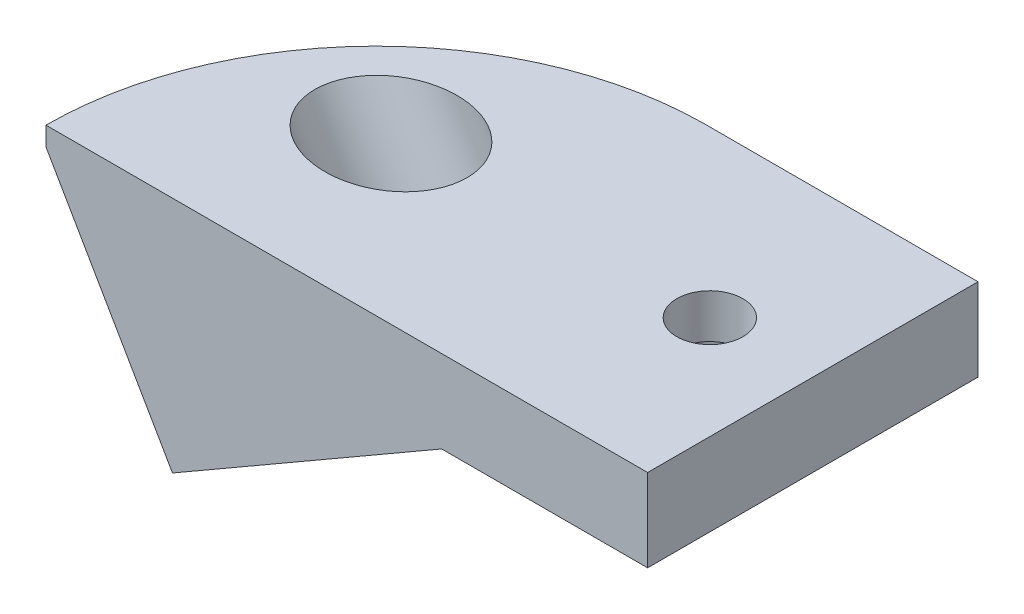
ISO-10303-21;
HEADER;
FILE_DESCRIPTION(('STEP AP214'),'2;1');
FILE_NAME('part.step','',(''),(''),'','','');
FILE_SCHEMA(('AUTOMOTIVE_DESIGN { 1 0 10303 214 1 1 1 1 }'));
ENDSEC;
DATA;
#1=APPLICATION_CONTEXT('core data for automotive mechanical design processes');
#2=APPLICATION_PROTOCOL_DEFINITION('international standard','automotive_design',2000,#1);
#3=PRODUCT_CONTEXT('',#1,'mechanical');
#4=PRODUCT('Part','Part','',(#3));
#5=PRODUCT_RELATED_PRODUCT_CATEGORY('part','',(#4));
#6=PRODUCT_DEFINITION_FORMATION('','',#4);
#7=PRODUCT_DEFINITION_CONTEXT('part definition',#1,'design');
#8=PRODUCT_DEFINITION('design','',#6,#7);
#9=PRODUCT_DEFINITION_SHAPE('','',#8);
#10=(LENGTH_UNIT() NAMED_UNIT(*) SI_UNIT(.MILLI.,.METRE.));
#11=(NAMED_UNIT(*) PLANE_ANGLE_UNIT() SI_UNIT($,.RADIAN.));
#12=(NAMED_UNIT(*) SI_UNIT($,.STERADIAN.) SOLID_ANGLE_UNIT());
#13=UNCERTAINTY_MEASURE_WITH_UNIT(LENGTH_MEASURE(1.E-05),#10,'distance_accuracy_value','');
#14=(GEOMETRIC_REPRESENTATION_CONTEXT(3) GLOBAL_UNCERTAINTY_ASSIGNED_CONTEXT((#13)) GLOBAL_UNIT_ASSIGNED_CONTEXT((#10,
#11,#12)) REPRESENTATION_CONTEXT('',''));
#15=CARTESIAN_POINT('',(0.,0.,0.));
#16=DIRECTION('',(0.,0.,1.));
#17=DIRECTION('',(1.,0.,0.));
#18=AXIS2_PLACEMENT_3D('',#15,#16,#17);
#19=CARTESIAN_POINT('',(-15.,22.775,15.));
#20=DIRECTION('',(0.,0.,-1.));
#21=DIRECTION('',(-1.,0.,0.));
#22=AXIS2_PLACEMENT_3D('',#19,#20,#21);
#23=PLANE('',#22);
#24=DIRECTION('',(0.,1.,0.));
#25=VECTOR('',#24,1.);
#26=CARTESIAN_POINT('',(-24.4749808628188,21.0521689850053,14.9999973566128));
#27=LINE('',#26,#25);
#28=CARTESIAN_POINT('',(-24.4749821845125,21.0521666957631,14.999998017461));
#29=VERTEX_POINT('',#28);
#30=CARTESIAN_POINT('',(-24.4749821845125,22.775,14.99999801746));
#31=VERTEX_POINT('',#30);
#32=EDGE_CURVE('E158',#29,#31,#27,.T.);
#33=ORIENTED_EDGE('',*,*,#32,.F.);
#34=DIRECTION('',(0.500000000000002,-0.866025403784438,0.));
#35=VECTOR('',#34,1.);
#36=CARTESIAN_POINT('',(-22.8522453423619,18.2415040378444,15.));
#37=LINE('',#36,#35);
#38=CARTESIAN_POINT('',(-12.9903810567666,1.16025403784439,15.));
#39=VERTEX_POINT('',#38);
#40=EDGE_CURVE('E147',#29,#39,#37,.T.);
#41=ORIENTED_EDGE('',*,*,#40,.T.);
#42=DIRECTION('',(-0.866025403784438,-0.500000000000001,0.));
#43=VECTOR('',#42,1.);
#44=CARTESIAN_POINT('',(-15.,0.,15.));
#45=LINE('',#44,#43);
#46=CARTESIAN_POINT('',(11.4570760856145,15.275,15.));
#47=VERTEX_POINT('',#46);
#48=EDGE_CURVE('E149',#47,#39,#45,.T.);
#49=ORIENTED_EDGE('',*,*,#48,.F.);
#50=DIRECTION('',(1.,0.,0.));
#51=VECTOR('',#50,1.);
#52=CARTESIAN_POINT('',(30.1570760856145,15.275,15.));
#53=LINE('',#52,#51);
#54=CARTESIAN_POINT('',(30.1570760856145,15.275,15.));
#55=VERTEX_POINT('',#54);
#56=EDGE_CURVE('E168',#47,#55,#53,.T.);
#57=ORIENTED_EDGE('',*,*,#56,.T.);
#58=DIRECTION('',(0.,1.,0.));
#59=VECTOR('',#58,1.);
#60=CARTESIAN_POINT('',(30.1570760856145,22.775,15.));
#61=LINE('',#60,#59);
#62=CARTESIAN_POINT('',(30.1570760856145,22.775,15.));
#63=VERTEX_POINT('',#62);
#64=EDGE_CURVE('E130',#55,#63,#61,.T.);
#65=ORIENTED_EDGE('',*,*,#64,.T.);
#66=DIRECTION('',(1.,0.,0.));
#67=VECTOR('',#66,1.);
#68=CARTESIAN_POINT('',(-15.,22.775,15.));
#69=LINE('',#68,#67);
#70=EDGE_CURVE('E110',#31,#63,#69,.T.);
#71=ORIENTED_EDGE('',*,*,#70,.F.);
#72=EDGE_LOOP('',(#33,#41,#49,#57,#65,#71));
#73=FACE_BOUND('',#72,.T.);
#74=ADVANCED_FACE('F40',(#73),#23,.F.);
#75=CARTESIAN_POINT('',(-22.8522453423619,18.2415040378444,15.));
#76=DIRECTION('',(-0.866025403784438,-0.500000000000002,0.));
#77=DIRECTION('',(0.500000000000002,-0.866025403784438,0.));
#78=AXIS2_PLACEMENT_3D('',#75,#76,#77);
#79=PLANE('',#78);
#80=CARTESIAN_POINT('',(5.52501649379283,-30.9093552420607,14.9999894264447));
#81=DIRECTION('',(-0.866025403784438,-0.500000000000002,0.));
#82=DIRECTION('',(-0.500000000000002,0.866025403784438,0.));
#83=AXIS2_PLACEMENT_3D('',#80,#81,#82);
#84=ELLIPSE('',#83,59.9999999999998,30.);
#85=CARTESIAN_POINT('',(-12.9903810567666,1.16025403784439,-8.60467226451663));
#86=VERTEX_POINT('',#85);
#87=EDGE_CURVE('E50',#86,#29,#84,.F.);
#88=ORIENTED_EDGE('',*,*,#87,.F.);
#89=DIRECTION('',(0.,0.,-1.));
#90=VECTOR('',#89,1.);
#91=CARTESIAN_POINT('',(-12.9903810567666,1.16025403784439,15.));
#92=LINE('',#91,#90);
#93=EDGE_CURVE('E143',#39,#86,#92,.T.);
#94=ORIENTED_EDGE('',*,*,#93,.F.);
#95=ORIENTED_EDGE('',*,*,#40,.F.);
#96=EDGE_LOOP('',(#88,#94,#95));
#97=FACE_BOUND('',#96,.T.);
#98=ADVANCED_FACE('F176',(#97),#79,.T.);
#99=CARTESIAN_POINT('',(-15.,22.775,-15.));
#100=DIRECTION('',(0.,0.,1.));
#101=DIRECTION('',(1.,0.,0.));
#102=AXIS2_PLACEMENT_3D('',#99,#100,#101);
#103=PLANE('',#102);
#104=DIRECTION('',(-0.866025403784438,-0.500000000000001,0.));
#105=VECTOR('',#104,1.);
#106=CARTESIAN_POINT('',(-15.,0.,-15.));
#107=LINE('',#106,#105);
#108=CARTESIAN_POINT('',(11.4570760856145,15.275,-15.));
#109=VERTEX_POINT('',#108);
#110=CARTESIAN_POINT('',(5.22196828695222,11.675158834016,-15.));
#111=VERTEX_POINT('',#110);
#112=EDGE_CURVE('E111',#109,#111,#107,.T.);
#113=ORIENTED_EDGE('',*,*,#112,.T.);
#114=DIRECTION('',(0.,1.,0.));
#115=VECTOR('',#114,1.);
#116=CARTESIAN_POINT('',(5.22196828695222,22.775,-15.));
#117=LINE('',#116,#115);
#118=CARTESIAN_POINT('',(5.22196828695222,22.775,-15.));
#119=VERTEX_POINT('',#118);
#120=EDGE_CURVE('E107',#111,#119,#117,.T.);
#121=ORIENTED_EDGE('',*,*,#120,.T.);
#122=DIRECTION('',(-1.,0.,0.));
#123=VECTOR('',#122,1.);
#124=CARTESIAN_POINT('',(-15.,22.775,-15.));
#125=LINE('',#124,#123);
#126=CARTESIAN_POINT('',(30.1570760856145,22.775,-15.));
#127=VERTEX_POINT('',#126);
#128=EDGE_CURVE('E102',#127,#119,#125,.T.);
#129=ORIENTED_EDGE('',*,*,#128,.F.);
#130=DIRECTION('',(0.,-1.,0.));
#131=VECTOR('',#130,1.);
#132=CARTESIAN_POINT('',(30.1570760856145,22.775,-15.));
#133=LINE('',#132,#131);
#134=CARTESIAN_POINT('',(30.1570760856145,15.275,-15.));
#135=VERTEX_POINT('',#134);
#136=EDGE_CURVE('E105',#127,#135,#133,.T.);
#137=ORIENTED_EDGE('',*,*,#136,.T.);
#138=DIRECTION('',(-1.,0.,0.));
#139=VECTOR('',#138,1.);
#140=CARTESIAN_POINT('',(30.1570760856145,15.275,-15.));
#141=LINE('',#140,#139);
#142=EDGE_CURVE('E121',#135,#109,#141,.T.);
#143=ORIENTED_EDGE('',*,*,#142,.T.);
#144=EDGE_LOOP('',(#113,#121,#129,#137,#143));
#145=FACE_BOUND('',#144,.T.);
#146=ADVANCED_FACE('F42',(#145),#103,.F.);
#147=CARTESIAN_POINT('',(0.,22.775,0.));
#148=DIRECTION('',(0.,-1.,0.));
#149=DIRECTION('',(0.,0.,-1.));
#150=AXIS2_PLACEMENT_3D('',#147,#148,#149);
#151=PLANE('',#150);
#152=CARTESIAN_POINT('',(20.8070760856145,22.775,0.));
#153=DIRECTION('',(0.,-1.,0.));
#154=DIRECTION('',(0.,0.,-1.));
#155=AXIS2_PLACEMENT_3D('',#152,#153,#154);
#156=CIRCLE('',#155,2.99999999999999);
#157=CARTESIAN_POINT('',(20.8070760856145,22.775,-2.99999999999999));
#158=VERTEX_POINT('',#157);
#159=EDGE_CURVE('E44',#158,#158,#156,.T.);
#160=ORIENTED_EDGE('',*,*,#159,.T.);
#161=EDGE_LOOP('',(#160));
#162=FACE_BOUND('',#161,.T.);
#163=CARTESIAN_POINT('',(-8.14914767260905,22.775,4.07721530149008E-06));
#164=DIRECTION('',(0.,-1.,0.));
#165=DIRECTION('',(1.,0.,0.));
#166=AXIS2_PLACEMENT_3D('',#163,#164,#165);
#167=ELLIPSE('',#166,6.92820323027552,6.);
#168=CARTESIAN_POINT('',(-1.22094444233353,22.775,4.07721530149008E-06));
#169=VERTEX_POINT('',#168);
#170=EDGE_CURVE('E144',#169,#169,#167,.T.);
#171=ORIENTED_EDGE('',*,*,#170,.T.);
#172=EDGE_LOOP('',(#171));
#173=FACE_BOUND('',#172,.T.);
#174=DIRECTION('',(0.,0.,-1.));
#175=VECTOR('',#174,1.);
#176=CARTESIAN_POINT('',(5.22196828695222,22.775,-14.998479897578));
#177=LINE('',#176,#175);
#178=CARTESIAN_POINT('',(5.22196828695222,22.775,-14.998479897578));
#179=VERTEX_POINT('',#178);
#180=EDGE_CURVE('E79',#179,#119,#177,.T.);
#181=ORIENTED_EDGE('',*,*,#180,.F.);
#182=CARTESIAN_POINT('',(5.52501649379283,22.775,14.9999894264447));
#183=DIRECTION('',(0.,-1.,0.));
#184=DIRECTION('',(0.,0.,1.));
#185=AXIS2_PLACEMENT_3D('',#182,#183,#184);
#186=CIRCLE('',#185,30.);
#187=EDGE_CURVE('E163',#31,#179,#186,.T.);
#188=ORIENTED_EDGE('',*,*,#187,.F.);
#189=ORIENTED_EDGE('',*,*,#70,.T.);
#190=DIRECTION('',(0.,0.,1.));
#191=VECTOR('',#190,1.);
#192=CARTESIAN_POINT('',(30.1570760856145,22.775,-37.2856559319545));
#193=LINE('',#192,#191);
#194=EDGE_CURVE('E117',#127,#63,#193,.T.);
#195=ORIENTED_EDGE('',*,*,#194,.F.);
#196=ORIENTED_EDGE('',*,*,#128,.T.);
#197=EDGE_LOOP('',(#181,#188,#189,#195,#196));
#198=FACE_BOUND('',#197,.T.);
#199=ADVANCED_FACE('F123',(#162,#173,#198),#151,.F.);
#200=CARTESIAN_POINT('',(-15.,0.,-15.));
#201=DIRECTION('',(-0.500000000000001,0.866025403784438,0.));
#202=DIRECTION('',(-0.866025403784438,-0.500000000000001,0.));
#203=AXIS2_PLACEMENT_3D('',#200,#201,#202);
#204=PLANE('',#203);
#205=CARTESIAN_POINT('',(3.53113851526976E-06,8.66025607654819,4.07721530149008E-06));
#206=DIRECTION('',(0.500000000000001,-0.866025403784438,0.));
#207=DIRECTION('',(0.866025403784438,0.500000000000001,0.));
#208=AXIS2_PLACEMENT_3D('',#205,#206,#207);
#209=CIRCLE('',#208,3.95);
#210=CARTESIAN_POINT('',(3.42080387608705,10.6352560765482,4.07721530149008E-06));
#211=VERTEX_POINT('',#210);
#212=EDGE_CURVE('E140',#211,#211,#209,.T.);
#213=ORIENTED_EDGE('',*,*,#212,.F.);
#214=EDGE_LOOP('',(#213));
#215=FACE_BOUND('',#214,.T.);
#216=ORIENTED_EDGE('',*,*,#93,.T.);
#217=CARTESIAN_POINT('',(5.52501649379283,11.8501237978128,14.9999894264447));
#218=DIRECTION('',(-0.500000000000001,0.866025403784438,0.));
#219=DIRECTION('',(0.866025403784438,0.500000000000001,0.));
#220=AXIS2_PLACEMENT_3D('',#217,#218,#219);
#221=ELLIPSE('',#220,34.6410161513776,30.);
#222=CARTESIAN_POINT('',(5.22196828695222,11.675158834016,-14.998479897578));
#223=VERTEX_POINT('',#222);
#224=EDGE_CURVE('E59',#86,#223,#221,.F.);
#225=ORIENTED_EDGE('',*,*,#224,.T.);
#226=DIRECTION('',(0.,0.,-1.));
#227=VECTOR('',#226,1.);
#228=CARTESIAN_POINT('',(5.22196828695222,11.675158834016,-15.));
#229=LINE('',#228,#227);
#230=EDGE_CURVE('E12',#223,#111,#229,.T.);
#231=ORIENTED_EDGE('',*,*,#230,.T.);
#232=ORIENTED_EDGE('',*,*,#112,.F.);
#233=DIRECTION('',(0.,0.,1.));
#234=VECTOR('',#233,1.);
#235=CARTESIAN_POINT('',(11.4570760856145,15.275,-37.2856559319545));
#236=LINE('',#235,#234);
#237=EDGE_CURVE('E127',#109,#47,#236,.T.);
#238=ORIENTED_EDGE('',*,*,#237,.T.);
#239=ORIENTED_EDGE('',*,*,#48,.T.);
#240=EDGE_LOOP('',(#216,#225,#231,#232,#238,#239));
#241=FACE_BOUND('',#240,.T.);
#242=ADVANCED_FACE('F178',(#215,#241),#204,.F.);
#243=CARTESIAN_POINT('',(-12.4792758685774,30.2750020387038,4.07721530149008E-06));
#244=DIRECTION('',(0.500000000000001,-0.866025403784438,0.));
#245=DIRECTION('',(0.866025403784438,0.500000000000001,0.));
#246=AXIS2_PLACEMENT_3D('',#243,#244,#245);
#247=CYLINDRICAL_SURFACE('',#246,3.95);
#248=CARTESIAN_POINT('',(-3.9999964688615,15.5884593068237,4.07721530149008E-06));
#249=DIRECTION('',(0.500000000000001,-0.866025403784438,0.));
#250=DIRECTION('',(0.866025403784438,0.500000000000001,0.));
#251=AXIS2_PLACEMENT_3D('',#248,#249,#250);
#252=CIRCLE('',#251,3.95);
#253=CARTESIAN_POINT('',(-0.579196123912965,17.5634593068237,4.07721530149008E-06));
#254=VERTEX_POINT('',#253);
#255=EDGE_CURVE('E139',#254,#254,#252,.F.);
#256=ORIENTED_EDGE('',*,*,#255,.T.);
#257=EDGE_LOOP('',(#256));
#258=FACE_BOUND('',#257,.T.);
#259=ORIENTED_EDGE('',*,*,#212,.T.);
#260=EDGE_LOOP('',(#259));
#261=FACE_BOUND('',#260,.T.);
#262=ADVANCED_FACE('F209',(#258,#261),#247,.F.);
#263=CARTESIAN_POINT('',(-16.4999964688615,37.2390944014346,4.07721530149008E-06));
#264=DIRECTION('',(0.500000000000001,-0.866025403784438,0.));
#265=DIRECTION('',(0.866025403784438,0.500000000000001,0.));
#266=AXIS2_PLACEMENT_3D('',#263,#264,#265);
#267=CYLINDRICAL_SURFACE('',#266,6.);
#268=CARTESIAN_POINT('',(-3.9999964688615,15.5884593068237,4.07721530149008E-06));
#269=DIRECTION('',(0.500000000000001,-0.866025403784438,0.));
#270=DIRECTION('',(0.866025403784438,0.500000000000001,0.));
#271=AXIS2_PLACEMENT_3D('',#268,#269,#270);
#272=CIRCLE('',#271,6.);
#273=CARTESIAN_POINT('',(1.19615595384513,18.5884593068237,4.07721530149008E-06));
#274=VERTEX_POINT('',#273);
#275=EDGE_CURVE('E136',#274,#274,#272,.T.);
#276=ORIENTED_EDGE('',*,*,#275,.T.);
#277=EDGE_LOOP('',(#276));
#278=FACE_BOUND('',#277,.T.);
#279=ORIENTED_EDGE('',*,*,#170,.F.);
#280=EDGE_LOOP('',(#279));
#281=FACE_BOUND('',#280,.T.);
#282=ADVANCED_FACE('F214',(#278,#281),#267,.F.);
#283=CARTESIAN_POINT('',(-3.9999964688615,15.5884593068237,4.07721530149008E-06));
#284=DIRECTION('',(0.500000000000001,-0.866025403784438,0.));
#285=DIRECTION('',(0.866025403784438,0.500000000000001,0.));
#286=AXIS2_PLACEMENT_3D('',#283,#284,#285);
#287=PLANE('',#286);
#288=ORIENTED_EDGE('',*,*,#275,.F.);
#289=EDGE_LOOP('',(#288));
#290=FACE_BOUND('',#289,.T.);
#291=ORIENTED_EDGE('',*,*,#255,.F.);
#292=EDGE_LOOP('',(#291));
#293=FACE_BOUND('',#292,.T.);
#294=ADVANCED_FACE('F195',(#290,#293),#287,.F.);
#295=CARTESIAN_POINT('',(30.1570760856145,22.775,-37.2856559319545));
#296=DIRECTION('',(1.,0.,0.));
#297=DIRECTION('',(0.,0.,-1.));
#298=AXIS2_PLACEMENT_3D('',#295,#296,#297);
#299=PLANE('',#298);
#300=ORIENTED_EDGE('',*,*,#136,.F.);
#301=ORIENTED_EDGE('',*,*,#194,.T.);
#302=ORIENTED_EDGE('',*,*,#64,.F.);
#303=DIRECTION('',(0.,0.,1.));
#304=VECTOR('',#303,1.);
#305=CARTESIAN_POINT('',(30.1570760856145,15.275,-37.2856559319545));
#306=LINE('',#305,#304);
#307=EDGE_CURVE('E119',#135,#55,#306,.T.);
#308=ORIENTED_EDGE('',*,*,#307,.F.);
#309=EDGE_LOOP('',(#300,#301,#302,#308));
#310=FACE_BOUND('',#309,.T.);
#311=ADVANCED_FACE('F115',(#310),#299,.T.);
#312=CARTESIAN_POINT('',(30.1570760856145,15.275,-37.2856559319545));
#313=DIRECTION('',(0.,-1.,0.));
#314=DIRECTION('',(0.,0.,-1.));
#315=AXIS2_PLACEMENT_3D('',#312,#313,#314);
#316=PLANE('',#315);
#317=CARTESIAN_POINT('',(20.8070760856145,15.275,0.));
#318=DIRECTION('',(0.,-1.,0.));
#319=DIRECTION('',(1.,0.,0.));
#320=AXIS2_PLACEMENT_3D('',#317,#318,#319);
#321=CIRCLE('',#320,6.35);
#322=CARTESIAN_POINT('',(27.1570760856145,15.275,0.));
#323=VERTEX_POINT('',#322);
#324=EDGE_CURVE('E316',#323,#323,#321,.T.);
#325=ORIENTED_EDGE('',*,*,#324,.F.);
#326=EDGE_LOOP('',(#325));
#327=FACE_BOUND('',#326,.T.);
#328=ORIENTED_EDGE('',*,*,#142,.F.);
#329=ORIENTED_EDGE('',*,*,#307,.T.);
#330=ORIENTED_EDGE('',*,*,#56,.F.);
#331=ORIENTED_EDGE('',*,*,#237,.F.);
#332=EDGE_LOOP('',(#328,#329,#330,#331));
#333=FACE_BOUND('',#332,.T.);
#334=ADVANCED_FACE('F182',(#327,#333),#316,.T.);
#335=CARTESIAN_POINT('',(5.22196828695222,-3.225,-14.998479897578));
#336=DIRECTION('',(1.,0.,0.));
#337=DIRECTION('',(0.,0.,-1.));
#338=AXIS2_PLACEMENT_3D('',#335,#336,#337);
#339=PLANE('',#338);
#340=ORIENTED_EDGE('',*,*,#230,.F.);
#341=DIRECTION('',(0.,1.,0.));
#342=VECTOR('',#341,1.);
#343=CARTESIAN_POINT('',(5.22196828695222,-3.225,-14.998479897578));
#344=LINE('',#343,#342);
#345=EDGE_CURVE('E159',#223,#179,#344,.T.);
#346=ORIENTED_EDGE('',*,*,#345,.T.);
#347=ORIENTED_EDGE('',*,*,#180,.T.);
#348=ORIENTED_EDGE('',*,*,#120,.F.);
#349=EDGE_LOOP('',(#340,#346,#347,#348));
#350=FACE_BOUND('',#349,.T.);
#351=ADVANCED_FACE('F184',(#350),#339,.F.);
#352=CARTESIAN_POINT('',(5.52501649379283,-3.225,14.9999894264447));
#353=DIRECTION('',(0.,1.,0.));
#354=DIRECTION('',(0.,0.,1.));
#355=AXIS2_PLACEMENT_3D('',#352,#353,#354);
#356=CYLINDRICAL_SURFACE('',#355,30.);
#357=ORIENTED_EDGE('',*,*,#87,.T.);
#358=ORIENTED_EDGE('',*,*,#32,.T.);
#359=ORIENTED_EDGE('',*,*,#187,.T.);
#360=ORIENTED_EDGE('',*,*,#345,.F.);
#361=ORIENTED_EDGE('',*,*,#224,.F.);
#362=EDGE_LOOP('',(#357,#358,#359,#360,#361));
#363=FACE_BOUND('',#362,.T.);
#364=ADVANCED_FACE('F192',(#363),#356,.T.);
#365=CARTESIAN_POINT('',(20.8070760856145,18.775,0.));
#366=DIRECTION('',(0.,-1.,0.));
#367=DIRECTION('',(1.,0.,0.));
#368=AXIS2_PLACEMENT_3D('',#365,#366,#367);
#369=CYLINDRICAL_SURFACE('',#368,6.35);
#370=CARTESIAN_POINT('',(20.8070760856145,18.775,0.));
#371=DIRECTION('',(0.,-1.,0.));
#372=DIRECTION('',(1.,0.,0.));
#373=AXIS2_PLACEMENT_3D('',#370,#371,#372);
#374=CIRCLE('',#373,6.35);
#375=CARTESIAN_POINT('',(27.1570760856145,18.775,0.));
#376=VERTEX_POINT('',#375);
#377=EDGE_CURVE('E169',#376,#376,#374,.T.);
#378=ORIENTED_EDGE('',*,*,#377,.F.);
#379=EDGE_LOOP('',(#378));
#380=FACE_BOUND('',#379,.T.);
#381=ORIENTED_EDGE('',*,*,#324,.T.);
#382=EDGE_LOOP('',(#381));
#383=FACE_BOUND('',#382,.T.);
#384=ADVANCED_FACE('F279',(#380,#383),#369,.F.);
#385=CARTESIAN_POINT('',(20.8070760856145,18.775,0.));
#386=DIRECTION('',(0.,-1.,0.));
#387=DIRECTION('',(1.,0.,0.));
#388=AXIS2_PLACEMENT_3D('',#385,#386,#387);
#389=PLANE('',#388);
#390=CARTESIAN_POINT('',(20.8070760856145,18.775,0.));
#391=DIRECTION('',(0.,-1.,0.));
#392=DIRECTION('',(1.,0.,0.));
#393=AXIS2_PLACEMENT_3D('',#390,#391,#392);
#394=CIRCLE('',#393,2.99999999999999);
#395=CARTESIAN_POINT('',(23.8070760856145,18.775,0.));
#396=VERTEX_POINT('',#395);
#397=EDGE_CURVE('E313',#396,#396,#394,.T.);
#398=ORIENTED_EDGE('',*,*,#397,.F.);
#399=EDGE_LOOP('',(#398));
#400=FACE_BOUND('',#399,.T.);
#401=ORIENTED_EDGE('',*,*,#377,.T.);
#402=EDGE_LOOP('',(#401));
#403=FACE_BOUND('',#402,.T.);
#404=ADVANCED_FACE('F287',(#400,#403),#389,.T.);
#405=CARTESIAN_POINT('',(20.8070760856145,44.775,0.));
#406=DIRECTION('',(0.,-1.,0.));
#407=DIRECTION('',(1.,0.,0.));
#408=AXIS2_PLACEMENT_3D('',#405,#406,#407);
#409=CYLINDRICAL_SURFACE('',#408,2.99999999999999);
#410=ORIENTED_EDGE('',*,*,#397,.T.);
#411=EDGE_LOOP('',(#410));
#412=FACE_BOUND('',#411,.T.);
#413=ORIENTED_EDGE('',*,*,#159,.F.);
#414=EDGE_LOOP('',(#413));
#415=FACE_BOUND('',#414,.T.);
#416=ADVANCED_FACE('F297',(#412,#415),#409,.F.);
#417=CLOSED_SHELL('',(#74,#98,#146,#199,#242,#262,#282,#294,#311,#334,#351,#364,#384,#404,#416));
#418=MANIFOLD_SOLID_BREP('B2',#417);
#419=ADVANCED_BREP_SHAPE_REPRESENTATION('',(#18,#418),#14);
#420=SHAPE_DEFINITION_REPRESENTATION(#9,#419);
ENDSEC;
END-ISO-10303-21;
